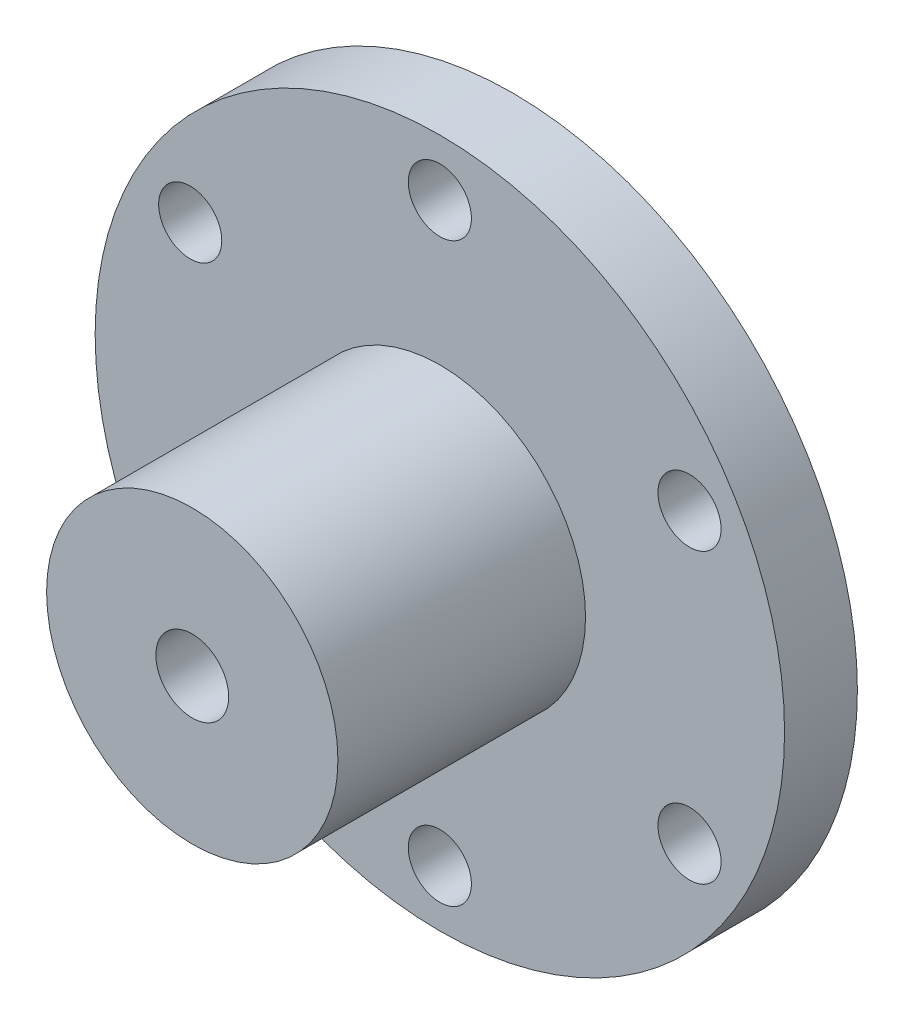
ISO-10303-21;
HEADER;
FILE_DESCRIPTION(('STEP AP214'),'2;1');
FILE_NAME('part.step','',(''),(''),'','','');
FILE_SCHEMA(('AUTOMOTIVE_DESIGN { 1 0 10303 214 1 1 1 1 }'));
ENDSEC;
DATA;
#1=APPLICATION_CONTEXT('core data for automotive mechanical design processes');
#2=APPLICATION_PROTOCOL_DEFINITION('international standard','automotive_design',2000,#1);
#3=PRODUCT_CONTEXT('',#1,'mechanical');
#4=PRODUCT('Part','Part','',(#3));
#5=PRODUCT_RELATED_PRODUCT_CATEGORY('part','',(#4));
#6=PRODUCT_DEFINITION_FORMATION('','',#4);
#7=PRODUCT_DEFINITION_CONTEXT('part definition',#1,'design');
#8=PRODUCT_DEFINITION('design','',#6,#7);
#9=PRODUCT_DEFINITION_SHAPE('','',#8);
#10=(LENGTH_UNIT() NAMED_UNIT(*) SI_UNIT(.MILLI.,.METRE.));
#11=(NAMED_UNIT(*) PLANE_ANGLE_UNIT() SI_UNIT($,.RADIAN.));
#12=(NAMED_UNIT(*) SI_UNIT($,.STERADIAN.) SOLID_ANGLE_UNIT());
#13=UNCERTAINTY_MEASURE_WITH_UNIT(LENGTH_MEASURE(1.E-05),#10,'distance_accuracy_value','');
#14=(GEOMETRIC_REPRESENTATION_CONTEXT(3) GLOBAL_UNCERTAINTY_ASSIGNED_CONTEXT((#13)) GLOBAL_UNIT_ASSIGNED_CONTEXT((#10,
#11,#12)) REPRESENTATION_CONTEXT('',''));
#15=CARTESIAN_POINT('',(0.,0.,0.));
#16=DIRECTION('',(0.,0.,1.));
#17=DIRECTION('',(1.,0.,0.));
#18=AXIS2_PLACEMENT_3D('',#15,#16,#17);
#19=CARTESIAN_POINT('',(0.,0.,0.));
#20=DIRECTION('',(0.,0.,1.));
#21=DIRECTION('',(1.,0.,0.));
#22=AXIS2_PLACEMENT_3D('',#19,#20,#21);
#23=CYLINDRICAL_SURFACE('',#22,12.);
#24=CARTESIAN_POINT('',(0.,0.,6.));
#25=DIRECTION('',(0.,0.,1.));
#26=DIRECTION('',(1.,0.,0.));
#27=AXIS2_PLACEMENT_3D('',#24,#25,#26);
#28=CIRCLE('',#27,12.);
#29=CARTESIAN_POINT('',(12.,0.,6.));
#30=VERTEX_POINT('',#29);
#31=EDGE_CURVE('E70',#30,#30,#28,.F.);
#32=ORIENTED_EDGE('',*,*,#31,.F.);
#33=EDGE_LOOP('',(#32));
#34=FACE_BOUND('',#33,.T.);
#35=CARTESIAN_POINT('',(0.,0.,26.4));
#36=DIRECTION('',(0.,0.,1.));
#37=DIRECTION('',(1.,0.,0.));
#38=AXIS2_PLACEMENT_3D('',#35,#36,#37);
#39=CIRCLE('',#38,12.);
#40=CARTESIAN_POINT('',(12.,0.,26.4));
#41=VERTEX_POINT('',#40);
#42=EDGE_CURVE('E18',#41,#41,#39,.T.);
#43=ORIENTED_EDGE('',*,*,#42,.F.);
#44=EDGE_LOOP('',(#43));
#45=FACE_BOUND('',#44,.T.);
#46=ADVANCED_FACE('F15',(#34,#45),#23,.T.);
#47=CARTESIAN_POINT('',(0.,0.,26.4));
#48=DIRECTION('',(0.,0.,1.));
#49=DIRECTION('',(1.,0.,0.));
#50=AXIS2_PLACEMENT_3D('',#47,#48,#49);
#51=PLANE('',#50);
#52=CARTESIAN_POINT('',(0.,0.,26.4));
#53=DIRECTION('',(0.,0.,1.));
#54=DIRECTION('',(1.,0.,0.));
#55=AXIS2_PLACEMENT_3D('',#52,#53,#54);
#56=CIRCLE('',#55,3.);
#57=CARTESIAN_POINT('',(3.,0.,26.4));
#58=VERTEX_POINT('',#57);
#59=EDGE_CURVE('E65',#58,#58,#56,.F.);
#60=ORIENTED_EDGE('',*,*,#59,.T.);
#61=EDGE_LOOP('',(#60));
#62=FACE_BOUND('',#61,.T.);
#63=ORIENTED_EDGE('',*,*,#42,.T.);
#64=EDGE_LOOP('',(#63));
#65=FACE_BOUND('',#64,.T.);
#66=ADVANCED_FACE('F77',(#62,#65),#51,.T.);
#67=CARTESIAN_POINT('',(0.,0.,6.));
#68=DIRECTION('',(0.,0.,1.));
#69=DIRECTION('',(1.,0.,0.));
#70=AXIS2_PLACEMENT_3D('',#67,#68,#69);
#71=PLANE('',#70);
#72=CARTESIAN_POINT('',(0.,-23.75,6.));
#73=DIRECTION('',(0.,0.,1.));
#74=DIRECTION('',(1.,0.,0.));
#75=AXIS2_PLACEMENT_3D('',#72,#73,#74);
#76=CIRCLE('',#75,2.6);
#77=CARTESIAN_POINT('',(2.6,-23.75,6.));
#78=VERTEX_POINT('',#77);
#79=EDGE_CURVE('E47',#78,#78,#76,.F.);
#80=ORIENTED_EDGE('',*,*,#79,.T.);
#81=EDGE_LOOP('',(#80));
#82=FACE_BOUND('',#81,.T.);
#83=CARTESIAN_POINT('',(20.5681033398804,11.875,6.));
#84=DIRECTION('',(0.,0.,1.));
#85=DIRECTION('',(1.,0.,0.));
#86=AXIS2_PLACEMENT_3D('',#83,#84,#85);
#87=CIRCLE('',#86,2.6);
#88=CARTESIAN_POINT('',(23.1681033398804,11.875,6.));
#89=VERTEX_POINT('',#88);
#90=EDGE_CURVE('E50',#89,#89,#87,.F.);
#91=ORIENTED_EDGE('',*,*,#90,.T.);
#92=EDGE_LOOP('',(#91));
#93=FACE_BOUND('',#92,.T.);
#94=CARTESIAN_POINT('',(0.,23.75,6.));
#95=DIRECTION('',(0.,0.,1.));
#96=DIRECTION('',(1.,0.,0.));
#97=AXIS2_PLACEMENT_3D('',#94,#95,#96);
#98=CIRCLE('',#97,2.6);
#99=CARTESIAN_POINT('',(2.6,23.75,6.));
#100=VERTEX_POINT('',#99);
#101=EDGE_CURVE('E53',#100,#100,#98,.F.);
#102=ORIENTED_EDGE('',*,*,#101,.T.);
#103=EDGE_LOOP('',(#102));
#104=FACE_BOUND('',#103,.T.);
#105=CARTESIAN_POINT('',(20.5681033398804,-11.875,6.));
#106=DIRECTION('',(0.,0.,1.));
#107=DIRECTION('',(1.,0.,0.));
#108=AXIS2_PLACEMENT_3D('',#105,#106,#107);
#109=CIRCLE('',#108,2.6);
#110=CARTESIAN_POINT('',(23.1681033398804,-11.875,6.));
#111=VERTEX_POINT('',#110);
#112=EDGE_CURVE('E56',#111,#111,#109,.F.);
#113=ORIENTED_EDGE('',*,*,#112,.T.);
#114=EDGE_LOOP('',(#113));
#115=FACE_BOUND('',#114,.T.);
#116=CARTESIAN_POINT('',(-20.5681033398804,-11.875,6.));
#117=DIRECTION('',(0.,0.,1.));
#118=DIRECTION('',(1.,0.,0.));
#119=AXIS2_PLACEMENT_3D('',#116,#117,#118);
#120=CIRCLE('',#119,2.6);
#121=CARTESIAN_POINT('',(-17.9681033398804,-11.875,6.));
#122=VERTEX_POINT('',#121);
#123=EDGE_CURVE('E59',#122,#122,#120,.F.);
#124=ORIENTED_EDGE('',*,*,#123,.T.);
#125=EDGE_LOOP('',(#124));
#126=FACE_BOUND('',#125,.T.);
#127=CARTESIAN_POINT('',(-20.5681033398804,11.875,6.));
#128=DIRECTION('',(0.,0.,1.));
#129=DIRECTION('',(1.,0.,0.));
#130=AXIS2_PLACEMENT_3D('',#127,#128,#129);
#131=CIRCLE('',#130,2.6);
#132=CARTESIAN_POINT('',(-17.9681033398804,11.875,6.));
#133=VERTEX_POINT('',#132);
#134=EDGE_CURVE('E62',#133,#133,#131,.F.);
#135=ORIENTED_EDGE('',*,*,#134,.T.);
#136=EDGE_LOOP('',(#135));
#137=FACE_BOUND('',#136,.T.);
#138=ORIENTED_EDGE('',*,*,#31,.T.);
#139=EDGE_LOOP('',(#138));
#140=FACE_BOUND('',#139,.T.);
#141=CARTESIAN_POINT('',(0.,0.,6.));
#142=DIRECTION('',(0.,0.,1.));
#143=DIRECTION('',(1.,0.,0.));
#144=AXIS2_PLACEMENT_3D('',#141,#142,#143);
#145=CIRCLE('',#144,28.4);
#146=CARTESIAN_POINT('',(28.4,0.,6.));
#147=VERTEX_POINT('',#146);
#148=EDGE_CURVE('E68',#147,#147,#145,.F.);
#149=ORIENTED_EDGE('',*,*,#148,.F.);
#150=EDGE_LOOP('',(#149));
#151=FACE_BOUND('',#150,.T.);
#152=ADVANCED_FACE('F85',(#82,#93,#104,#115,#126,#137,#140,#151),#71,.T.);
#153=CARTESIAN_POINT('',(0.,0.,0.));
#154=DIRECTION('',(0.,0.,1.));
#155=DIRECTION('',(1.,0.,0.));
#156=AXIS2_PLACEMENT_3D('',#153,#154,#155);
#157=CYLINDRICAL_SURFACE('',#156,28.4);
#158=CARTESIAN_POINT('',(0.,0.,0.));
#159=DIRECTION('',(0.,0.,1.));
#160=DIRECTION('',(1.,0.,0.));
#161=AXIS2_PLACEMENT_3D('',#158,#159,#160);
#162=CIRCLE('',#161,28.4);
#163=CARTESIAN_POINT('',(28.4,0.,0.));
#164=VERTEX_POINT('',#163);
#165=EDGE_CURVE('E44',#164,#164,#162,.T.);
#166=ORIENTED_EDGE('',*,*,#165,.T.);
#167=EDGE_LOOP('',(#166));
#168=FACE_BOUND('',#167,.T.);
#169=ORIENTED_EDGE('',*,*,#148,.T.);
#170=EDGE_LOOP('',(#169));
#171=FACE_BOUND('',#170,.T.);
#172=ADVANCED_FACE('F121',(#168,#171),#157,.T.);
#173=CARTESIAN_POINT('',(0.,0.,0.));
#174=DIRECTION('',(0.,0.,1.));
#175=DIRECTION('',(1.,0.,0.));
#176=AXIS2_PLACEMENT_3D('',#173,#174,#175);
#177=CYLINDRICAL_SURFACE('',#176,3.);
#178=CARTESIAN_POINT('',(0.,0.,0.));
#179=DIRECTION('',(0.,0.,1.));
#180=DIRECTION('',(1.,0.,0.));
#181=AXIS2_PLACEMENT_3D('',#178,#179,#180);
#182=CIRCLE('',#181,3.);
#183=CARTESIAN_POINT('',(3.,0.,0.));
#184=VERTEX_POINT('',#183);
#185=EDGE_CURVE('E41',#184,#184,#182,.F.);
#186=ORIENTED_EDGE('',*,*,#185,.T.);
#187=EDGE_LOOP('',(#186));
#188=FACE_BOUND('',#187,.T.);
#189=ORIENTED_EDGE('',*,*,#59,.F.);
#190=EDGE_LOOP('',(#189));
#191=FACE_BOUND('',#190,.T.);
#192=ADVANCED_FACE('F117',(#188,#191),#177,.F.);
#193=CARTESIAN_POINT('',(-20.5681033398804,11.875,0.));
#194=DIRECTION('',(0.,0.,1.));
#195=DIRECTION('',(1.,0.,0.));
#196=AXIS2_PLACEMENT_3D('',#193,#194,#195);
#197=CYLINDRICAL_SURFACE('',#196,2.6);
#198=CARTESIAN_POINT('',(-20.5681033398804,11.875,0.));
#199=DIRECTION('',(0.,0.,1.));
#200=DIRECTION('',(1.,0.,0.));
#201=AXIS2_PLACEMENT_3D('',#198,#199,#200);
#202=CIRCLE('',#201,2.6);
#203=CARTESIAN_POINT('',(-17.9681033398804,11.875,0.));
#204=VERTEX_POINT('',#203);
#205=EDGE_CURVE('E38',#204,#204,#202,.F.);
#206=ORIENTED_EDGE('',*,*,#205,.T.);
#207=EDGE_LOOP('',(#206));
#208=FACE_BOUND('',#207,.T.);
#209=ORIENTED_EDGE('',*,*,#134,.F.);
#210=EDGE_LOOP('',(#209));
#211=FACE_BOUND('',#210,.T.);
#212=ADVANCED_FACE('F113',(#208,#211),#197,.F.);
#213=CARTESIAN_POINT('',(-20.5681033398804,-11.875,0.));
#214=DIRECTION('',(0.,0.,1.));
#215=DIRECTION('',(1.,0.,0.));
#216=AXIS2_PLACEMENT_3D('',#213,#214,#215);
#217=CYLINDRICAL_SURFACE('',#216,2.6);
#218=CARTESIAN_POINT('',(-20.5681033398804,-11.875,0.));
#219=DIRECTION('',(0.,0.,1.));
#220=DIRECTION('',(1.,0.,0.));
#221=AXIS2_PLACEMENT_3D('',#218,#219,#220);
#222=CIRCLE('',#221,2.6);
#223=CARTESIAN_POINT('',(-17.9681033398804,-11.875,0.));
#224=VERTEX_POINT('',#223);
#225=EDGE_CURVE('E35',#224,#224,#222,.F.);
#226=ORIENTED_EDGE('',*,*,#225,.T.);
#227=EDGE_LOOP('',(#226));
#228=FACE_BOUND('',#227,.T.);
#229=ORIENTED_EDGE('',*,*,#123,.F.);
#230=EDGE_LOOP('',(#229));
#231=FACE_BOUND('',#230,.T.);
#232=ADVANCED_FACE('F109',(#228,#231),#217,.F.);
#233=CARTESIAN_POINT('',(20.5681033398804,-11.875,0.));
#234=DIRECTION('',(0.,0.,1.));
#235=DIRECTION('',(1.,0.,0.));
#236=AXIS2_PLACEMENT_3D('',#233,#234,#235);
#237=CYLINDRICAL_SURFACE('',#236,2.6);
#238=CARTESIAN_POINT('',(20.5681033398804,-11.875,0.));
#239=DIRECTION('',(0.,0.,1.));
#240=DIRECTION('',(1.,0.,0.));
#241=AXIS2_PLACEMENT_3D('',#238,#239,#240);
#242=CIRCLE('',#241,2.6);
#243=CARTESIAN_POINT('',(23.1681033398804,-11.875,0.));
#244=VERTEX_POINT('',#243);
#245=EDGE_CURVE('E32',#244,#244,#242,.F.);
#246=ORIENTED_EDGE('',*,*,#245,.T.);
#247=EDGE_LOOP('',(#246));
#248=FACE_BOUND('',#247,.T.);
#249=ORIENTED_EDGE('',*,*,#112,.F.);
#250=EDGE_LOOP('',(#249));
#251=FACE_BOUND('',#250,.T.);
#252=ADVANCED_FACE('F105',(#248,#251),#237,.F.);
#253=CARTESIAN_POINT('',(0.,23.75,0.));
#254=DIRECTION('',(0.,0.,1.));
#255=DIRECTION('',(1.,0.,0.));
#256=AXIS2_PLACEMENT_3D('',#253,#254,#255);
#257=CYLINDRICAL_SURFACE('',#256,2.6);
#258=CARTESIAN_POINT('',(0.,23.75,0.));
#259=DIRECTION('',(0.,0.,1.));
#260=DIRECTION('',(1.,0.,0.));
#261=AXIS2_PLACEMENT_3D('',#258,#259,#260);
#262=CIRCLE('',#261,2.6);
#263=CARTESIAN_POINT('',(2.6,23.75,0.));
#264=VERTEX_POINT('',#263);
#265=EDGE_CURVE('E27',#264,#264,#262,.F.);
#266=ORIENTED_EDGE('',*,*,#265,.T.);
#267=EDGE_LOOP('',(#266));
#268=FACE_BOUND('',#267,.T.);
#269=ORIENTED_EDGE('',*,*,#101,.F.);
#270=EDGE_LOOP('',(#269));
#271=FACE_BOUND('',#270,.T.);
#272=ADVANCED_FACE('F101',(#268,#271),#257,.F.);
#273=CARTESIAN_POINT('',(20.5681033398804,11.875,0.));
#274=DIRECTION('',(0.,0.,1.));
#275=DIRECTION('',(1.,0.,0.));
#276=AXIS2_PLACEMENT_3D('',#273,#274,#275);
#277=CYLINDRICAL_SURFACE('',#276,2.6);
#278=CARTESIAN_POINT('',(20.5681033398804,11.875,0.));
#279=DIRECTION('',(0.,0.,1.));
#280=DIRECTION('',(1.,0.,0.));
#281=AXIS2_PLACEMENT_3D('',#278,#279,#280);
#282=CIRCLE('',#281,2.6);
#283=CARTESIAN_POINT('',(23.1681033398804,11.875,0.));
#284=VERTEX_POINT('',#283);
#285=EDGE_CURVE('E22',#284,#284,#282,.F.);
#286=ORIENTED_EDGE('',*,*,#285,.T.);
#287=EDGE_LOOP('',(#286));
#288=FACE_BOUND('',#287,.T.);
#289=ORIENTED_EDGE('',*,*,#90,.F.);
#290=EDGE_LOOP('',(#289));
#291=FACE_BOUND('',#290,.T.);
#292=ADVANCED_FACE('F95',(#288,#291),#277,.F.);
#293=CARTESIAN_POINT('',(0.,-23.75,0.));
#294=DIRECTION('',(0.,0.,1.));
#295=DIRECTION('',(1.,0.,0.));
#296=AXIS2_PLACEMENT_3D('',#293,#294,#295);
#297=CYLINDRICAL_SURFACE('',#296,2.6);
#298=CARTESIAN_POINT('',(0.,-23.75,0.));
#299=DIRECTION('',(0.,0.,1.));
#300=DIRECTION('',(1.,0.,0.));
#301=AXIS2_PLACEMENT_3D('',#298,#299,#300);
#302=CIRCLE('',#301,2.6);
#303=CARTESIAN_POINT('',(2.6,-23.75,0.));
#304=VERTEX_POINT('',#303);
#305=EDGE_CURVE('E10',#304,#304,#302,.F.);
#306=ORIENTED_EDGE('',*,*,#305,.T.);
#307=EDGE_LOOP('',(#306));
#308=FACE_BOUND('',#307,.T.);
#309=ORIENTED_EDGE('',*,*,#79,.F.);
#310=EDGE_LOOP('',(#309));
#311=FACE_BOUND('',#310,.T.);
#312=ADVANCED_FACE('F89',(#308,#311),#297,.F.);
#313=CARTESIAN_POINT('',(0.,0.,0.));
#314=DIRECTION('',(0.,0.,1.));
#315=DIRECTION('',(1.,0.,0.));
#316=AXIS2_PLACEMENT_3D('',#313,#314,#315);
#317=PLANE('',#316);
#318=ORIENTED_EDGE('',*,*,#305,.F.);
#319=EDGE_LOOP('',(#318));
#320=FACE_BOUND('',#319,.T.);
#321=ORIENTED_EDGE('',*,*,#285,.F.);
#322=EDGE_LOOP('',(#321));
#323=FACE_BOUND('',#322,.T.);
#324=ORIENTED_EDGE('',*,*,#265,.F.);
#325=EDGE_LOOP('',(#324));
#326=FACE_BOUND('',#325,.T.);
#327=ORIENTED_EDGE('',*,*,#245,.F.);
#328=EDGE_LOOP('',(#327));
#329=FACE_BOUND('',#328,.T.);
#330=ORIENTED_EDGE('',*,*,#225,.F.);
#331=EDGE_LOOP('',(#330));
#332=FACE_BOUND('',#331,.T.);
#333=ORIENTED_EDGE('',*,*,#205,.F.);
#334=EDGE_LOOP('',(#333));
#335=FACE_BOUND('',#334,.T.);
#336=ORIENTED_EDGE('',*,*,#185,.F.);
#337=EDGE_LOOP('',(#336));
#338=FACE_BOUND('',#337,.T.);
#339=ORIENTED_EDGE('',*,*,#165,.F.);
#340=EDGE_LOOP('',(#339));
#341=FACE_BOUND('',#340,.T.);
#342=ADVANCED_FACE('F87',(#320,#323,#326,#329,#332,#335,#338,#341),#317,.F.);
#343=CLOSED_SHELL('',(#46,#66,#152,#172,#192,#212,#232,#252,#272,#292,#312,#342));
#344=MANIFOLD_SOLID_BREP('B1',#343);
#345=ADVANCED_BREP_SHAPE_REPRESENTATION('',(#18,#344),#14);
#346=SHAPE_DEFINITION_REPRESENTATION(#9,#345);
ENDSEC;
END-ISO-10303-21;
